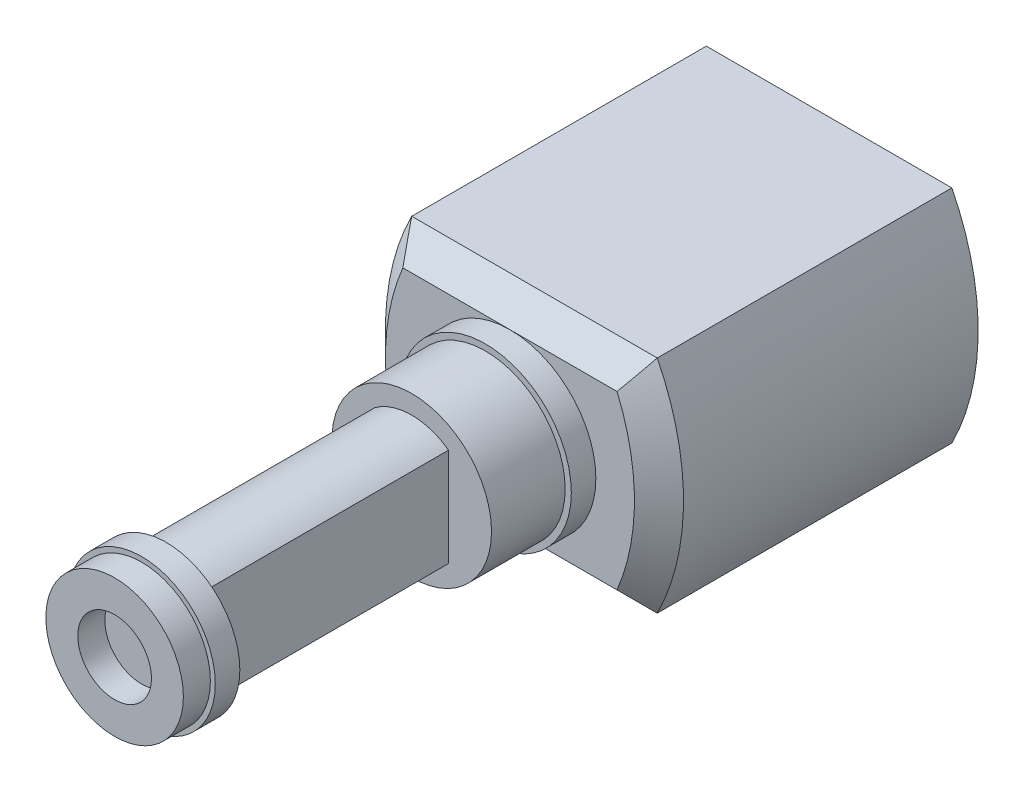
ISO-10303-21;
HEADER;
FILE_DESCRIPTION(('STEP AP214'),'2;1');
FILE_NAME('part.step','',(''),(''),'','','');
FILE_SCHEMA(('AUTOMOTIVE_DESIGN { 1 0 10303 214 1 1 1 1 }'));
ENDSEC;
DATA;
#1=APPLICATION_CONTEXT('core data for automotive mechanical design processes');
#2=APPLICATION_PROTOCOL_DEFINITION('international standard','automotive_design',2000,#1);
#3=PRODUCT_CONTEXT('',#1,'mechanical');
#4=PRODUCT('Part','Part','',(#3));
#5=PRODUCT_RELATED_PRODUCT_CATEGORY('part','',(#4));
#6=PRODUCT_DEFINITION_FORMATION('','',#4);
#7=PRODUCT_DEFINITION_CONTEXT('part definition',#1,'design');
#8=PRODUCT_DEFINITION('design','',#6,#7);
#9=PRODUCT_DEFINITION_SHAPE('','',#8);
#10=(LENGTH_UNIT() NAMED_UNIT(*) SI_UNIT(.MILLI.,.METRE.));
#11=(NAMED_UNIT(*) PLANE_ANGLE_UNIT() SI_UNIT($,.RADIAN.));
#12=(NAMED_UNIT(*) SI_UNIT($,.STERADIAN.) SOLID_ANGLE_UNIT());
#13=UNCERTAINTY_MEASURE_WITH_UNIT(LENGTH_MEASURE(1.E-05),#10,'distance_accuracy_value','');
#14=(GEOMETRIC_REPRESENTATION_CONTEXT(3) GLOBAL_UNCERTAINTY_ASSIGNED_CONTEXT((#13)) GLOBAL_UNIT_ASSIGNED_CONTEXT((#10,
#11,#12)) REPRESENTATION_CONTEXT('',''));
#15=CARTESIAN_POINT('',(0.,0.,0.));
#16=DIRECTION('',(0.,0.,1.));
#17=DIRECTION('',(1.,0.,0.));
#18=AXIS2_PLACEMENT_3D('',#15,#16,#17);
#19=CARTESIAN_POINT('',(-50.,-45.,120.));
#20=DIRECTION('',(0.,1.,0.));
#21=DIRECTION('',(0.,0.,1.));
#22=AXIS2_PLACEMENT_3D('',#19,#20,#21);
#23=PLANE('',#22);
#24=DIRECTION('',(-1.,0.,0.));
#25=VECTOR('',#24,1.);
#26=CARTESIAN_POINT('',(16.,-45.,85.));
#27=LINE('',#26,#25);
#28=CARTESIAN_POINT('',(16.,-45.,85.));
#29=VERTEX_POINT('',#28);
#30=CARTESIAN_POINT('',(-39.,-45.,85.));
#31=VERTEX_POINT('',#30);
#32=EDGE_CURVE('E71',#29,#31,#27,.T.);
#33=ORIENTED_EDGE('',*,*,#32,.F.);
#34=DIRECTION('',(0.,0.,1.));
#35=VECTOR('',#34,1.);
#36=CARTESIAN_POINT('',(16.,-45.,85.));
#37=LINE('',#36,#35);
#38=CARTESIAN_POINT('',(16.,-45.,35.));
#39=VERTEX_POINT('',#38);
#40=EDGE_CURVE('E66',#39,#29,#37,.T.);
#41=ORIENTED_EDGE('',*,*,#40,.F.);
#42=DIRECTION('',(-1.,0.,0.));
#43=VECTOR('',#42,1.);
#44=CARTESIAN_POINT('',(16.,-45.,35.));
#45=LINE('',#44,#43);
#46=CARTESIAN_POINT('',(-39.,-45.,35.));
#47=VERTEX_POINT('',#46);
#48=EDGE_CURVE('E201',#39,#47,#45,.T.);
#49=ORIENTED_EDGE('',*,*,#48,.T.);
#50=DIRECTION('',(0.,0.,1.));
#51=VECTOR('',#50,1.);
#52=CARTESIAN_POINT('',(-39.,-45.,120.));
#53=LINE('',#52,#51);
#54=CARTESIAN_POINT('',(-39.,-45.,20.));
#55=VERTEX_POINT('',#54);
#56=EDGE_CURVE('E358',#55,#47,#53,.T.);
#57=ORIENTED_EDGE('',*,*,#56,.F.);
#58=DIRECTION('',(1.,0.,0.));
#59=VECTOR('',#58,1.);
#60=CARTESIAN_POINT('',(-61.,-45.,20.));
#61=LINE('',#60,#59);
#62=CARTESIAN_POINT('',(-50.,-45.,20.));
#63=VERTEX_POINT('',#62);
#64=EDGE_CURVE('E59',#63,#55,#61,.T.);
#65=ORIENTED_EDGE('',*,*,#64,.F.);
#66=DIRECTION('',(0.,0.,-1.));
#67=VECTOR('',#66,1.);
#68=CARTESIAN_POINT('',(-50.,-45.,120.));
#69=LINE('',#68,#67);
#70=CARTESIAN_POINT('',(-50.,-45.,0.));
#71=VERTEX_POINT('',#70);
#72=EDGE_CURVE('E695',#63,#71,#69,.T.);
#73=ORIENTED_EDGE('',*,*,#72,.T.);
#74=DIRECTION('',(1.,0.,0.));
#75=VECTOR('',#74,1.);
#76=CARTESIAN_POINT('',(-50.,-45.,0.));
#77=LINE('',#76,#75);
#78=CARTESIAN_POINT('',(50.,-45.,0.));
#79=VERTEX_POINT('',#78);
#80=EDGE_CURVE('E680',#71,#79,#77,.T.);
#81=ORIENTED_EDGE('',*,*,#80,.T.);
#82=DIRECTION('',(0.,0.,-1.));
#83=VECTOR('',#82,1.);
#84=CARTESIAN_POINT('',(50.,-45.,120.));
#85=LINE('',#84,#83);
#86=CARTESIAN_POINT('',(50.,-45.,120.));
#87=VERTEX_POINT('',#86);
#88=EDGE_CURVE('E691',#87,#79,#85,.T.);
#89=ORIENTED_EDGE('',*,*,#88,.F.);
#90=DIRECTION('',(1.,0.,0.));
#91=VECTOR('',#90,1.);
#92=CARTESIAN_POINT('',(-50.,-45.,120.));
#93=LINE('',#92,#91);
#94=CARTESIAN_POINT('',(-50.,-45.,120.));
#95=VERTEX_POINT('',#94);
#96=EDGE_CURVE('E654',#95,#87,#93,.T.);
#97=ORIENTED_EDGE('',*,*,#96,.F.);
#98=CARTESIAN_POINT('',(-50.,-45.,100.));
#99=VERTEX_POINT('',#98);
#100=EDGE_CURVE('E696',#95,#99,#69,.T.);
#101=ORIENTED_EDGE('',*,*,#100,.T.);
#102=DIRECTION('',(1.,0.,0.));
#103=VECTOR('',#102,1.);
#104=CARTESIAN_POINT('',(-61.,-45.,100.));
#105=LINE('',#104,#103);
#106=CARTESIAN_POINT('',(-39.,-45.,100.));
#107=VERTEX_POINT('',#106);
#108=EDGE_CURVE('E11',#107,#99,#105,.F.);
#109=ORIENTED_EDGE('',*,*,#108,.F.);
#110=EDGE_CURVE('E350',#31,#107,#53,.T.);
#111=ORIENTED_EDGE('',*,*,#110,.F.);
#112=EDGE_LOOP('',(#33,#41,#49,#57,#65,#73,#81,#89,#97,#101,#109,#111));
#113=FACE_BOUND('',#112,.T.);
#114=ADVANCED_FACE('F49',(#113),#23,.F.);
#115=CARTESIAN_POINT('',(-39.,-45.,60.));
#116=DIRECTION('',(-1.,0.,0.));
#117=DIRECTION('',(0.,0.,1.));
#118=AXIS2_PLACEMENT_3D('',#115,#116,#117);
#119=PLANE('',#118);
#120=DIRECTION('',(0.,-1.,0.));
#121=VECTOR('',#120,1.);
#122=CARTESIAN_POINT('',(-39.,-45.,85.));
#123=LINE('',#122,#121);
#124=CARTESIAN_POINT('',(-39.,-72.,85.));
#125=VERTEX_POINT('',#124);
#126=EDGE_CURVE('E192',#31,#125,#123,.T.);
#127=ORIENTED_EDGE('',*,*,#126,.F.);
#128=ORIENTED_EDGE('',*,*,#110,.T.);
#129=CARTESIAN_POINT('',(-39.,-45.,60.));
#130=DIRECTION('',(-1.,0.,0.));
#131=DIRECTION('',(0.,0.,1.));
#132=AXIS2_PLACEMENT_3D('',#129,#130,#131);
#133=CIRCLE('',#132,40.);
#134=EDGE_CURVE('E194',#55,#107,#133,.T.);
#135=ORIENTED_EDGE('',*,*,#134,.F.);
#136=ORIENTED_EDGE('',*,*,#56,.T.);
#137=DIRECTION('',(0.,1.,0.));
#138=VECTOR('',#137,1.);
#139=CARTESIAN_POINT('',(-39.,-45.,35.));
#140=LINE('',#139,#138);
#141=CARTESIAN_POINT('',(-39.,-72.,35.));
#142=VERTEX_POINT('',#141);
#143=EDGE_CURVE('E189',#142,#47,#140,.T.);
#144=ORIENTED_EDGE('',*,*,#143,.F.);
#145=CARTESIAN_POINT('',(-39.,-9.38517357398977,60.));
#146=DIRECTION('',(1.,0.,0.));
#147=DIRECTION('',(0.,0.,-1.));
#148=AXIS2_PLACEMENT_3D('',#145,#146,#147);
#149=CIRCLE('',#148,67.4211872363531);
#150=EDGE_CURVE('E352',#125,#142,#149,.T.);
#151=ORIENTED_EDGE('',*,*,#150,.F.);
#152=EDGE_LOOP('',(#127,#128,#135,#136,#144,#151));
#153=FACE_BOUND('',#152,.T.);
#154=ADVANCED_FACE('F227',(#153),#119,.F.);
#155=CARTESIAN_POINT('',(39.3028554974588,0.,120.));
#156=DIRECTION('',(0.,0.,-1.));
#157=DIRECTION('',(-1.,0.,0.));
#158=AXIS2_PLACEMENT_3D('',#155,#156,#157);
#159=CYLINDRICAL_SURFACE('',#158,100.);
#160=CARTESIAN_POINT('',(-50.,-45.,100.));
#161=CARTESIAN_POINT('',(-50.2575145026989,-44.4889804950428,100.000004959184));
#162=CARTESIAN_POINT('',(-50.5106326873442,-43.9757305050414,99.9902069155624));
#163=CARTESIAN_POINT('',(-51.0077513577765,-42.9455579457033,99.9505307291951));
#164=CARTESIAN_POINT('',(-51.2517511360193,-42.428635095059,99.9206510316117));
#165=CARTESIAN_POINT('',(-51.7303912522015,-41.391717468259,99.840316600475));
#166=CARTESIAN_POINT('',(-51.9650267016564,-40.8717212461962,99.789851270884));
#167=CARTESIAN_POINT('',(-52.4244740255998,-39.8299050493603,99.6679378151953));
#168=CARTESIAN_POINT('',(-52.6492861218073,-39.308085116037,99.5964901629626));
#169=CARTESIAN_POINT('',(-53.3092096445117,-37.7397882514892,99.3498377402756));
#170=CARTESIAN_POINT('',(-53.7292147486106,-36.6917616100942,99.1424207839221));
#171=CARTESIAN_POINT('',(-54.5268864944688,-34.6010369531128,98.6395862258692));
#172=CARTESIAN_POINT('',(-54.9045611222125,-33.5583379679674,98.3441852616505));
#173=CARTESIAN_POINT('',(-55.6181238744516,-31.4835703939032,97.6630096287439));
#174=CARTESIAN_POINT('',(-55.9538571281414,-30.4515534023426,97.276914345942));
#175=CARTESIAN_POINT('',(-56.5819842178003,-28.4119069849537,96.4151198297498));
#176=CARTESIAN_POINT('',(-56.8743750524622,-27.4042792520327,95.9394143963525));
#177=CARTESIAN_POINT('',(-57.4164433001584,-25.4249642338286,94.900792144347));
#178=CARTESIAN_POINT('',(-57.666180673093,-24.4532280267028,94.3379999060999));
#179=CARTESIAN_POINT('',(-58.125424075549,-22.5540440887892,93.1277347231729));
#180=CARTESIAN_POINT('',(-58.3349324993936,-21.6265937246924,92.480266822028));
#181=CARTESIAN_POINT('',(-58.7059783214294,-19.8752367925533,91.1430896171818));
#182=CARTESIAN_POINT('',(-58.8695324360717,-19.0484403311266,90.4577175180242));
#183=CARTESIAN_POINT('',(-59.1662561613783,-17.4497875447128,89.0196763352655));
#184=CARTESIAN_POINT('',(-59.2994267893559,-16.6779293808529,88.2670095060311));
#185=CARTESIAN_POINT('',(-59.5387828447042,-15.1952287244079,86.6990732348288));
#186=CARTESIAN_POINT('',(-59.6449536310704,-14.4844194741274,85.8837701382276));
#187=CARTESIAN_POINT('',(-59.8337695315128,-13.1300141528581,84.1965763893211));
#188=CARTESIAN_POINT('',(-59.9164142924848,-12.4864190907849,83.3246848879165));
#189=CARTESIAN_POINT('',(-60.0618863771138,-11.270481226524,81.528985502298));
#190=CARTESIAN_POINT('',(-60.1246821155331,-10.698252855488,80.6050976018441));
#191=CARTESIAN_POINT('',(-60.2337769808131,-9.63052034694264,78.7130935635876));
#192=CARTESIAN_POINT('',(-60.2800761712338,-9.13501591382643,77.7449775962082));
#193=CARTESIAN_POINT('',(-60.3594193075909,-8.22435323407913,75.7712684558029));
#194=CARTESIAN_POINT('',(-60.3924645525275,-7.80918711566974,74.7656789660663));
#195=CARTESIAN_POINT('',(-60.4481735082475,-7.06205521218068,72.7237693849129));
#196=CARTESIAN_POINT('',(-60.4708370477071,-6.73009080017593,71.6874487866573));
#197=CARTESIAN_POINT('',(-60.5086067050459,-6.14492596714399,69.5666707930246));
#198=CARTESIAN_POINT('',(-60.5235247445409,-5.89373753930624,68.4816544140698));
#199=CARTESIAN_POINT('',(-60.5469452598326,-5.48267409038658,66.29438537262));
#200=CARTESIAN_POINT('',(-60.5554476413231,-5.32280041158509,65.1921324570013));
#201=CARTESIAN_POINT('',(-60.5673052838955,-5.09548640111748,62.9779915436194));
#202=CARTESIAN_POINT('',(-60.5706600086419,-5.02805570118581,61.8661025540068));
#203=CARTESIAN_POINT('',(-60.572761699177,-4.98613345843167,59.6405706708872));
#204=CARTESIAN_POINT('',(-60.5715086561313,-5.01164209380126,58.5269277740215));
#205=CARTESIAN_POINT('',(-60.5641588243351,-5.15603833517959,56.2961191903085));
#206=CARTESIAN_POINT('',(-60.5580205548909,-5.2757255170237,55.1790053042739));
#207=CARTESIAN_POINT('',(-60.5398772185023,-5.60860473061139,52.958836391483));
#208=CARTESIAN_POINT('',(-60.5278721042186,-5.82179751684534,51.8557814782415));
#209=CARTESIAN_POINT('',(-60.4962917242754,-6.3401545462993,49.67158218095));
#210=CARTESIAN_POINT('',(-60.4767163217885,-6.64532045184538,48.5904381932959));
#211=CARTESIAN_POINT('',(-60.4276222636608,-7.34539491460195,46.457835423632));
#212=CARTESIAN_POINT('',(-60.3981036394846,-7.74030318782793,45.4063765476972));
#213=CARTESIAN_POINT('',(-60.3262048869344,-8.61644826687708,43.3418723773045));
#214=CARTESIAN_POINT('',(-60.2838389092234,-9.09758985411858,42.3287861915279));
#215=CARTESIAN_POINT('',(-60.1828136852166,-10.1428377651297,40.3471878132357));
#216=CARTESIAN_POINT('',(-60.1241544152144,-10.7069442096111,39.3786756855769));
#217=CARTESIAN_POINT('',(-59.9867858690692,-11.9136770106138,37.4933830784486));
#218=CARTESIAN_POINT('',(-59.9080770643757,-12.556301520658,36.5766013831968));
#219=CARTESIAN_POINT('',(-59.7266701552798,-13.914828544418,34.8015652001785));
#220=CARTESIAN_POINT('',(-59.62397244248,-14.6307298618335,33.9433097573067));
#221=CARTESIAN_POINT('',(-59.3922998183614,-16.1190970482872,32.3033904581545));
#222=CARTESIAN_POINT('',(-59.2637173208638,-16.8906191128443,31.5208146208771));
#223=CARTESIAN_POINT('',(-58.9758151717442,-18.4922880086693,30.0243039276647));
#224=CARTESIAN_POINT('',(-58.816495782265,-19.3224343399157,29.3103684864005));
#225=CARTESIAN_POINT('',(-58.4639736496879,-21.0335357027999,27.956304726088));
#226=CARTESIAN_POINT('',(-58.2707857482991,-21.914468366053,27.3161442805068));
#227=CARTESIAN_POINT('',(-57.8478086523549,-23.719344626821,26.1132807598742));
#228=CARTESIAN_POINT('',(-57.6180205780592,-24.6432869072829,25.5505753150589));
#229=CARTESIAN_POINT('',(-57.1256063416069,-26.5038931893504,24.5176079311349));
#230=CARTESIAN_POINT('',(-56.8638578746364,-27.439774729962,24.045516142323));
#231=CARTESIAN_POINT('',(-56.3024205760292,-29.336136218961,23.1797636127467));
#232=CARTESIAN_POINT('',(-56.0027304959743,-30.2966169759228,22.7861054538337));
#233=CARTESIAN_POINT('',(-55.3649558849523,-32.2342417241874,22.0777096776537));
#234=CARTESIAN_POINT('',(-55.0268548837521,-33.2113927097455,21.7630061023256));
#235=CARTESIAN_POINT('',(-54.3128041965,-35.1738240224274,21.2123150966895));
#236=CARTESIAN_POINT('',(-53.936861542153,-36.1591028081267,20.9763130771459));
#237=CARTESIAN_POINT('',(-53.2784234181899,-37.8049383771586,20.6466646295495));
#238=CARTESIAN_POINT('',(-53.0060183937048,-38.4653821105773,20.5317404253973));
#239=CARTESIAN_POINT('',(-52.4452360501806,-39.7844324164767,20.3358822477574));
#240=CARTESIAN_POINT('',(-52.1568612609275,-40.443039262677,20.2549429080289));
#241=CARTESIAN_POINT('',(-51.5655357162397,-41.7546556494803,20.1264409342995));
#242=CARTESIAN_POINT('',(-51.2626286723406,-42.4076757732124,20.0787841838325));
#243=CARTESIAN_POINT('',(-50.6421453911592,-43.7083203255714,20.0155557304445));
#244=CARTESIAN_POINT('',(-50.3245685145279,-44.3559445175751,19.9999854272849));
#245=CARTESIAN_POINT('',(-50.,-45.,20.));
#246=B_SPLINE_CURVE_WITH_KNOTS('',3,(#160,#161,#162,#163,#164,#165,#166,#167,#168,#169,#170,
#171,#172,#173,#174,#175,#176,#177,#178,#179,#180,#181,#182,#183,#184,#185,#186,#187,#188,#189,
#190,#191,#192,#193,#194,#195,#196,#197,#198,#199,#200,#201,#202,#203,#204,#205,#206,#207,#208,
#209,#210,#211,#212,#213,#214,#215,#216,#217,#218,#219,#220,#221,#222,#223,#224,#225,#226,#227,
#228,#229,#230,#231,#232,#233,#234,#235,#236,#237,#238,#239,#240,#241,#242,#243,#244,#245),
.UNSPECIFIED.,.F.,.F.,(4,2,2,2,2,2,2,2,2,2,2,2,2,2,2,2,2,2,2,2,2,2,2,2,2,2,2,2,2,2,2,2,2,2,2,2,
2,2,2,2,2,2,4),(0.,1.71662188098538,3.43337668809481,5.1510162773036,6.868617078296,
10.3080686730842,13.7468702915872,17.1980164158165,20.6494014080071,24.0958939690318,
27.5421813400996,30.7972467681108,34.0522031925905,37.3089209125645,40.5656875103304,
43.8276107270397,47.0895213756898,50.3511122509723,53.6127569486334,56.9502793027659,
60.2878507155184,63.6257698470419,66.9636953783418,70.3302697246236,73.6968712360653,
77.0635335992552,80.4301853089859,83.7931422208729,87.1561040258278,90.5189867606124,
93.8818146024949,97.1970550807682,100.512267285915,103.826030328377,107.139691962509,
110.377073638897,113.61456186471,116.853443571425,120.091724538949,122.261626977542,
124.431186657615,126.594586142898,128.75808000382),.UNSPECIFIED.);
#247=EDGE_CURVE('E207',#99,#63,#246,.T.);
#248=ORIENTED_EDGE('',*,*,#247,.F.);
#249=ORIENTED_EDGE('',*,*,#100,.F.);
#250=CARTESIAN_POINT('',(39.3028554974588,0.,120.));
#251=DIRECTION('',(0.,0.,1.));
#252=DIRECTION('',(1.,0.,0.));
#253=AXIS2_PLACEMENT_3D('',#250,#251,#252);
#254=CIRCLE('',#253,100.);
#255=CARTESIAN_POINT('',(-50.,45.,120.));
#256=VERTEX_POINT('',#255);
#257=EDGE_CURVE('E645',#256,#95,#254,.T.);
#258=ORIENTED_EDGE('',*,*,#257,.F.);
#259=DIRECTION('',(0.,0.,-1.));
#260=VECTOR('',#259,1.);
#261=CARTESIAN_POINT('',(-50.,45.,120.));
#262=LINE('',#261,#260);
#263=CARTESIAN_POINT('',(-50.,45.,0.));
#264=VERTEX_POINT('',#263);
#265=EDGE_CURVE('E675',#256,#264,#262,.T.);
#266=ORIENTED_EDGE('',*,*,#265,.T.);
#267=CARTESIAN_POINT('',(39.3028554974588,0.,0.));
#268=DIRECTION('',(0.,0.,1.));
#269=DIRECTION('',(1.,0.,0.));
#270=AXIS2_PLACEMENT_3D('',#267,#268,#269);
#271=CIRCLE('',#270,100.);
#272=EDGE_CURVE('E676',#264,#71,#271,.T.);
#273=ORIENTED_EDGE('',*,*,#272,.T.);
#274=ORIENTED_EDGE('',*,*,#72,.F.);
#275=EDGE_LOOP('',(#248,#249,#258,#266,#273,#274));
#276=FACE_BOUND('',#275,.T.);
#277=ADVANCED_FACE('F51',(#276),#159,.T.);
#278=CARTESIAN_POINT('',(39.3028554974588,0.,130.));
#279=DIRECTION('',(0.,0.,1.));
#280=DIRECTION('',(1.,0.,0.));
#281=AXIS2_PLACEMENT_3D('',#278,#279,#280);
#282=PLANE('',#281);
#283=CARTESIAN_POINT('',(0.,0.,130.));
#284=DIRECTION('',(0.,0.,1.));
#285=DIRECTION('',(1.,0.,0.));
#286=AXIS2_PLACEMENT_3D('',#283,#284,#285);
#287=CIRCLE('',#286,35.);
#288=CARTESIAN_POINT('',(0.,35.,130.));
#289=VERTEX_POINT('',#288);
#290=CARTESIAN_POINT('',(0.,-34.9999999999999,130.));
#291=VERTEX_POINT('',#290);
#292=EDGE_CURVE('E708',#289,#291,#287,.T.);
#293=ORIENTED_EDGE('',*,*,#292,.F.);
#294=DIRECTION('',(1.,0.,0.));
#295=VECTOR('',#294,1.);
#296=CARTESIAN_POINT('',(50.,35.,130.));
#297=LINE('',#296,#295);
#298=CARTESIAN_POINT('',(-43.6127642614262,35.,130.));
#299=VERTEX_POINT('',#298);
#300=EDGE_CURVE('E724',#289,#299,#297,.F.);
#301=ORIENTED_EDGE('',*,*,#300,.T.);
#302=CARTESIAN_POINT('',(39.3028554974588,0.,130.));
#303=DIRECTION('',(0.,0.,1.));
#304=DIRECTION('',(1.,0.,0.));
#305=AXIS2_PLACEMENT_3D('',#302,#303,#304);
#306=CIRCLE('',#305,90.);
#307=CARTESIAN_POINT('',(-43.6127642614262,-34.9999999999999,130.));
#308=VERTEX_POINT('',#307);
#309=EDGE_CURVE('E320',#299,#308,#306,.T.);
#310=ORIENTED_EDGE('',*,*,#309,.T.);
#311=DIRECTION('',(-1.,0.,0.));
#312=VECTOR('',#311,1.);
#313=CARTESIAN_POINT('',(-50.,-34.9999999999999,130.));
#314=LINE('',#313,#312);
#315=EDGE_CURVE('E734',#308,#291,#314,.F.);
#316=ORIENTED_EDGE('',*,*,#315,.T.);
#317=EDGE_LOOP('',(#293,#301,#310,#316));
#318=FACE_BOUND('',#317,.T.);
#319=ADVANCED_FACE('F285',(#318),#282,.T.);
#320=CARTESIAN_POINT('',(-39.3028554974588,0.,120.));
#321=DIRECTION('',(0.,0.,-1.));
#322=DIRECTION('',(-1.,0.,0.));
#323=AXIS2_PLACEMENT_3D('',#320,#321,#322);
#324=CYLINDRICAL_SURFACE('',#323,100.);
#325=CARTESIAN_POINT('',(-39.3028554974588,0.,0.));
#326=DIRECTION('',(0.,0.,1.));
#327=DIRECTION('',(-1.,0.,0.));
#328=AXIS2_PLACEMENT_3D('',#325,#326,#327);
#329=CIRCLE('',#328,100.);
#330=CARTESIAN_POINT('',(50.,45.,0.));
#331=VERTEX_POINT('',#330);
#332=EDGE_CURVE('E662',#79,#331,#329,.T.);
#333=ORIENTED_EDGE('',*,*,#332,.T.);
#334=DIRECTION('',(0.,0.,-1.));
#335=VECTOR('',#334,1.);
#336=CARTESIAN_POINT('',(50.,45.,120.));
#337=LINE('',#336,#335);
#338=CARTESIAN_POINT('',(50.,45.,120.));
#339=VERTEX_POINT('',#338);
#340=EDGE_CURVE('E687',#339,#331,#337,.T.);
#341=ORIENTED_EDGE('',*,*,#340,.F.);
#342=CARTESIAN_POINT('',(-39.3028554974588,0.,120.));
#343=DIRECTION('',(0.,0.,1.));
#344=DIRECTION('',(-1.,0.,0.));
#345=AXIS2_PLACEMENT_3D('',#342,#343,#344);
#346=CIRCLE('',#345,100.);
#347=EDGE_CURVE('E660',#87,#339,#346,.T.);
#348=ORIENTED_EDGE('',*,*,#347,.F.);
#349=ORIENTED_EDGE('',*,*,#88,.T.);
#350=EDGE_LOOP('',(#333,#341,#348,#349));
#351=FACE_BOUND('',#350,.T.);
#352=ADVANCED_FACE('F335',(#351),#324,.T.);
#353=CARTESIAN_POINT('',(-50.,45.,120.));
#354=DIRECTION('',(0.,-1.,0.));
#355=DIRECTION('',(0.,0.,-1.));
#356=AXIS2_PLACEMENT_3D('',#353,#354,#355);
#357=PLANE('',#356);
#358=DIRECTION('',(-1.,0.,0.));
#359=VECTOR('',#358,1.);
#360=CARTESIAN_POINT('',(-50.,45.,0.));
#361=LINE('',#360,#359);
#362=EDGE_CURVE('E655',#331,#264,#361,.T.);
#363=ORIENTED_EDGE('',*,*,#362,.T.);
#364=ORIENTED_EDGE('',*,*,#265,.F.);
#365=DIRECTION('',(-1.,0.,0.));
#366=VECTOR('',#365,1.);
#367=CARTESIAN_POINT('',(-50.,45.,120.));
#368=LINE('',#367,#366);
#369=EDGE_CURVE('E671',#339,#256,#368,.T.);
#370=ORIENTED_EDGE('',*,*,#369,.F.);
#371=ORIENTED_EDGE('',*,*,#340,.T.);
#372=EDGE_LOOP('',(#363,#364,#370,#371));
#373=FACE_BOUND('',#372,.T.);
#374=ADVANCED_FACE('F331',(#373),#357,.F.);
#375=CARTESIAN_POINT('',(39.3028554974588,0.,0.));
#376=DIRECTION('',(0.,0.,1.));
#377=DIRECTION('',(1.,0.,0.));
#378=AXIS2_PLACEMENT_3D('',#375,#376,#377);
#379=PLANE('',#378);
#380=ORIENTED_EDGE('',*,*,#272,.F.);
#381=ORIENTED_EDGE('',*,*,#362,.F.);
#382=ORIENTED_EDGE('',*,*,#332,.F.);
#383=ORIENTED_EDGE('',*,*,#80,.F.);
#384=EDGE_LOOP('',(#380,#381,#382,#383));
#385=FACE_BOUND('',#384,.T.);
#386=ADVANCED_FACE('F327',(#385),#379,.F.);
#387=CARTESIAN_POINT('',(39.3028554974588,0.,120.));
#388=DIRECTION('',(0.,0.,-1.));
#389=DIRECTION('',(1.,0.,0.));
#390=AXIS2_PLACEMENT_3D('',#387,#388,#389);
#391=CONICAL_SURFACE('',#390,100.,0.78539816339745);
#392=ORIENTED_EDGE('',*,*,#257,.T.);
#393=CARTESIAN_POINT('',(-43.6127642614262,-34.9999999999999,130.));
#394=CARTESIAN_POINT('',(-44.1619231895788,-35.827897686687,129.172102313313));
#395=CARTESIAN_POINT('',(-44.7066190332412,-36.657272926264,128.342727073736));
#396=CARTESIAN_POINT('',(-45.7874293356179,-38.3187662385271,126.681233761473));
#397=CARTESIAN_POINT('',(-46.3235442082515,-39.1508841765649,125.849115823435));
#398=CARTESIAN_POINT('',(-47.3875871165562,-40.8177255827111,124.182274417289));
#399=CARTESIAN_POINT('',(-47.9155152030539,-41.652449034605,123.347550965395));
#400=CARTESIAN_POINT('',(-48.9635481765775,-43.3243965865883,121.675603413412));
#401=CARTESIAN_POINT('',(-49.4836526838744,-44.1616208057075,120.838379194292));
#402=CARTESIAN_POINT('',(-50.,-45.,120.));
#403=B_SPLINE_CURVE_WITH_KNOTS('',3,(#393,#394,#395,#396,#397,#398,#399,#400,#401,#402),
.UNSPECIFIED.,.F.,.F.,(4,2,2,2,4),(0.,3.87963028203751,7.75907285537981,11.6384913341418,
15.5180975026528),.UNSPECIFIED.);
#404=EDGE_CURVE('E297',#308,#95,#403,.T.);
#405=ORIENTED_EDGE('',*,*,#404,.F.);
#406=ORIENTED_EDGE('',*,*,#309,.F.);
#407=CARTESIAN_POINT('',(-43.6127642614262,35.,130.));
#408=CARTESIAN_POINT('',(-44.1619231895788,35.8278976866871,129.172102313313));
#409=CARTESIAN_POINT('',(-44.7066190332412,36.6572729262641,128.342727073736));
#410=CARTESIAN_POINT('',(-45.7874293356179,38.3187662385272,126.681233761473));
#411=CARTESIAN_POINT('',(-46.3235442082514,39.1508841765649,125.849115823435));
#412=CARTESIAN_POINT('',(-47.3875871165562,40.8177255827111,124.182274417289));
#413=CARTESIAN_POINT('',(-47.9155152030539,41.652449034605,123.347550965395));
#414=CARTESIAN_POINT('',(-48.9635481765775,43.3243965865883,121.675603413412));
#415=CARTESIAN_POINT('',(-49.4836526838743,44.1616208057076,120.838379194292));
#416=CARTESIAN_POINT('',(-50.,45.,120.));
#417=B_SPLINE_CURVE_WITH_KNOTS('',3,(#407,#408,#409,#410,#411,#412,#413,#414,#415,#416),
.UNSPECIFIED.,.F.,.F.,(4,2,2,2,4),(0.,3.8796302820375,7.75907285537979,11.6384913341418,
15.5180975026528),.UNSPECIFIED.);
#418=EDGE_CURVE('E649',#299,#256,#417,.T.);
#419=ORIENTED_EDGE('',*,*,#418,.T.);
#420=EDGE_LOOP('',(#392,#405,#406,#419));
#421=FACE_BOUND('',#420,.T.);
#422=ADVANCED_FACE('F291',(#421),#391,.T.);
#423=CARTESIAN_POINT('',(-50.,-45.,120.));
#424=DIRECTION('',(0.,-0.707106781186546,0.707106781186549));
#425=DIRECTION('',(0.,-0.707106781186549,-0.707106781186546));
#426=AXIS2_PLACEMENT_3D('',#423,#424,#425);
#427=PLANE('',#426);
#428=ORIENTED_EDGE('',*,*,#96,.T.);
#429=CARTESIAN_POINT('',(43.6127642614262,-34.9999999999999,130.));
#430=CARTESIAN_POINT('',(44.1619231895788,-35.827897686687,129.172102313313));
#431=CARTESIAN_POINT('',(44.7066190332412,-36.657272926264,128.342727073736));
#432=CARTESIAN_POINT('',(45.7874293356179,-38.3187662385271,126.681233761473));
#433=CARTESIAN_POINT('',(46.3235442082515,-39.1508841765649,125.849115823435));
#434=CARTESIAN_POINT('',(47.3875871165562,-40.8177255827111,124.182274417289));
#435=CARTESIAN_POINT('',(47.9155152030539,-41.652449034605,123.347550965395));
#436=CARTESIAN_POINT('',(48.9635481765775,-43.3243965865883,121.675603413412));
#437=CARTESIAN_POINT('',(49.4836526838744,-44.1616208057075,120.838379194292));
#438=CARTESIAN_POINT('',(50.,-45.,120.));
#439=B_SPLINE_CURVE_WITH_KNOTS('',3,(#429,#430,#431,#432,#433,#434,#435,#436,#437,#438),
.UNSPECIFIED.,.F.,.F.,(4,2,2,2,4),(0.,3.87963028203751,7.75907285537981,11.6384913341418,
15.5180975026528),.UNSPECIFIED.);
#440=CARTESIAN_POINT('',(43.6127642614262,-34.9999999999999,130.));
#441=VERTEX_POINT('',#440);
#442=EDGE_CURVE('E305',#441,#87,#439,.T.);
#443=ORIENTED_EDGE('',*,*,#442,.F.);
#444=EDGE_CURVE('E737',#291,#441,#314,.F.);
#445=ORIENTED_EDGE('',*,*,#444,.F.);
#446=ORIENTED_EDGE('',*,*,#315,.F.);
#447=ORIENTED_EDGE('',*,*,#404,.T.);
#448=EDGE_LOOP('',(#428,#443,#445,#446,#447));
#449=FACE_BOUND('',#448,.T.);
#450=ADVANCED_FACE('F286',(#449),#427,.T.);
#451=CARTESIAN_POINT('',(-39.3028554974588,0.,120.));
#452=DIRECTION('',(0.,0.,-1.));
#453=DIRECTION('',(1.,0.,0.));
#454=AXIS2_PLACEMENT_3D('',#451,#452,#453);
#455=CONICAL_SURFACE('',#454,100.,0.78539816339745);
#456=ORIENTED_EDGE('',*,*,#347,.T.);
#457=CARTESIAN_POINT('',(43.6127642614262,35.,130.));
#458=CARTESIAN_POINT('',(44.1619231895787,35.8278976866871,129.172102313313));
#459=CARTESIAN_POINT('',(44.7066190332412,36.6572729262641,128.342727073736));
#460=CARTESIAN_POINT('',(45.7874293356179,38.3187662385272,126.681233761473));
#461=CARTESIAN_POINT('',(46.3235442082514,39.1508841765649,125.849115823435));
#462=CARTESIAN_POINT('',(47.3875871165562,40.8177255827111,124.182274417289));
#463=CARTESIAN_POINT('',(47.9155152030539,41.652449034605,123.347550965395));
#464=CARTESIAN_POINT('',(48.9635481765775,43.3243965865884,121.675603413412));
#465=CARTESIAN_POINT('',(49.4836526838743,44.1616208057076,120.838379194292));
#466=CARTESIAN_POINT('',(50.,45.,120.));
#467=B_SPLINE_CURVE_WITH_KNOTS('',3,(#457,#458,#459,#460,#461,#462,#463,#464,#465,#466),
.UNSPECIFIED.,.F.,.F.,(4,2,2,2,4),(0.,3.87963028203751,7.75907285537981,11.6384913341418,
15.5180975026528),.UNSPECIFIED.);
#468=CARTESIAN_POINT('',(43.6127642614262,35.,130.));
#469=VERTEX_POINT('',#468);
#470=EDGE_CURVE('E315',#469,#339,#467,.T.);
#471=ORIENTED_EDGE('',*,*,#470,.F.);
#472=CARTESIAN_POINT('',(-39.3028554974588,0.,130.));
#473=DIRECTION('',(0.,0.,1.));
#474=DIRECTION('',(1.,0.,0.));
#475=AXIS2_PLACEMENT_3D('',#472,#473,#474);
#476=CIRCLE('',#475,90.);
#477=EDGE_CURVE('E730',#441,#469,#476,.T.);
#478=ORIENTED_EDGE('',*,*,#477,.F.);
#479=ORIENTED_EDGE('',*,*,#442,.T.);
#480=EDGE_LOOP('',(#456,#471,#478,#479));
#481=FACE_BOUND('',#480,.T.);
#482=ADVANCED_FACE('F290',(#481),#455,.T.);
#483=CARTESIAN_POINT('',(50.,45.,120.));
#484=DIRECTION('',(0.,0.707106781186546,0.707106781186549));
#485=DIRECTION('',(0.,-0.707106781186549,0.707106781186546));
#486=AXIS2_PLACEMENT_3D('',#483,#484,#485);
#487=PLANE('',#486);
#488=ORIENTED_EDGE('',*,*,#369,.T.);
#489=ORIENTED_EDGE('',*,*,#418,.F.);
#490=ORIENTED_EDGE('',*,*,#300,.F.);
#491=EDGE_CURVE('E665',#469,#289,#297,.F.);
#492=ORIENTED_EDGE('',*,*,#491,.F.);
#493=ORIENTED_EDGE('',*,*,#470,.T.);
#494=EDGE_LOOP('',(#488,#489,#490,#492,#493));
#495=FACE_BOUND('',#494,.T.);
#496=ADVANCED_FACE('F283',(#495),#487,.T.);
#497=EDGE_CURVE('E698',#291,#289,#287,.T.);
#498=ORIENTED_EDGE('',*,*,#497,.F.);
#499=ORIENTED_EDGE('',*,*,#444,.T.);
#500=ORIENTED_EDGE('',*,*,#477,.T.);
#501=ORIENTED_EDGE('',*,*,#491,.T.);
#502=EDGE_LOOP('',(#498,#499,#500,#501));
#503=FACE_BOUND('',#502,.T.);
#504=ADVANCED_FACE('F279',(#503),#282,.T.);
#505=CARTESIAN_POINT('',(0.,0.,140.));
#506=DIRECTION('',(0.,0.,-1.));
#507=DIRECTION('',(-1.,0.,0.));
#508=AXIS2_PLACEMENT_3D('',#505,#506,#507);
#509=CYLINDRICAL_SURFACE('',#508,35.);
#510=CARTESIAN_POINT('',(0.,0.,140.));
#511=DIRECTION('',(0.,0.,1.));
#512=DIRECTION('',(1.,0.,0.));
#513=AXIS2_PLACEMENT_3D('',#510,#511,#512);
#514=CIRCLE('',#513,35.);
#515=CARTESIAN_POINT('',(35.,0.,140.));
#516=VERTEX_POINT('',#515);
#517=EDGE_CURVE('E743',#516,#516,#514,.T.);
#518=ORIENTED_EDGE('',*,*,#517,.F.);
#519=EDGE_LOOP('',(#518));
#520=FACE_BOUND('',#519,.T.);
#521=ORIENTED_EDGE('',*,*,#292,.T.);
#522=ORIENTED_EDGE('',*,*,#497,.T.);
#523=EDGE_LOOP('',(#521,#522));
#524=FACE_BOUND('',#523,.T.);
#525=ADVANCED_FACE('F275',(#520,#524),#509,.T.);
#526=CARTESIAN_POINT('',(0.,0.,140.));
#527=DIRECTION('',(0.,0.,1.));
#528=DIRECTION('',(1.,0.,0.));
#529=AXIS2_PLACEMENT_3D('',#526,#527,#528);
#530=PLANE('',#529);
#531=CARTESIAN_POINT('',(0.,0.,140.));
#532=DIRECTION('',(0.,0.,1.));
#533=DIRECTION('',(1.,0.,0.));
#534=AXIS2_PLACEMENT_3D('',#531,#532,#533);
#535=CIRCLE('',#534,32.5);
#536=CARTESIAN_POINT('',(32.5,0.,140.));
#537=VERTEX_POINT('',#536);
#538=EDGE_CURVE('E703',#537,#537,#535,.T.);
#539=ORIENTED_EDGE('',*,*,#538,.F.);
#540=EDGE_LOOP('',(#539));
#541=FACE_BOUND('',#540,.T.);
#542=ORIENTED_EDGE('',*,*,#517,.T.);
#543=EDGE_LOOP('',(#542));
#544=FACE_BOUND('',#543,.T.);
#545=ADVANCED_FACE('F271',(#541,#544),#530,.T.);
#546=CARTESIAN_POINT('',(0.,0.,170.));
#547=DIRECTION('',(0.,0.,-1.));
#548=DIRECTION('',(-1.,0.,0.));
#549=AXIS2_PLACEMENT_3D('',#546,#547,#548);
#550=CYLINDRICAL_SURFACE('',#549,32.5);
#551=CARTESIAN_POINT('',(0.,0.,170.));
#552=DIRECTION('',(0.,0.,1.));
#553=DIRECTION('',(1.,0.,0.));
#554=AXIS2_PLACEMENT_3D('',#551,#552,#553);
#555=CIRCLE('',#554,32.5);
#556=CARTESIAN_POINT('',(32.5,0.,170.));
#557=VERTEX_POINT('',#556);
#558=EDGE_CURVE('E750',#557,#557,#555,.T.);
#559=ORIENTED_EDGE('',*,*,#558,.F.);
#560=EDGE_LOOP('',(#559));
#561=FACE_BOUND('',#560,.T.);
#562=ORIENTED_EDGE('',*,*,#538,.T.);
#563=EDGE_LOOP('',(#562));
#564=FACE_BOUND('',#563,.T.);
#565=ADVANCED_FACE('F267',(#561,#564),#550,.T.);
#566=CARTESIAN_POINT('',(0.,0.,170.));
#567=DIRECTION('',(0.,0.,1.));
#568=DIRECTION('',(1.,0.,0.));
#569=AXIS2_PLACEMENT_3D('',#566,#567,#568);
#570=PLANE('',#569);
#571=CARTESIAN_POINT('',(0.,-0.676277990128409,170.));
#572=DIRECTION('',(0.,0.,1.));
#573=DIRECTION('',(-1.,0.,0.));
#574=AXIS2_PLACEMENT_3D('',#571,#572,#573);
#575=CIRCLE('',#574,25.5442453700451);
#576=CARTESIAN_POINT('',(15.,20.,170.));
#577=VERTEX_POINT('',#576);
#578=CARTESIAN_POINT('',(-15.,20.,170.));
#579=VERTEX_POINT('',#578);
#580=EDGE_CURVE('E785',#577,#579,#575,.T.);
#581=ORIENTED_EDGE('',*,*,#580,.F.);
#582=DIRECTION('',(0.,1.,0.));
#583=VECTOR('',#582,1.);
#584=CARTESIAN_POINT('',(15.,20.,170.));
#585=LINE('',#584,#583);
#586=CARTESIAN_POINT('',(15.,-20.,170.));
#587=VERTEX_POINT('',#586);
#588=EDGE_CURVE('E772',#587,#577,#585,.T.);
#589=ORIENTED_EDGE('',*,*,#588,.F.);
#590=CARTESIAN_POINT('',(0.,0.676277990128409,170.));
#591=DIRECTION('',(0.,0.,1.));
#592=DIRECTION('',(1.,0.,0.));
#593=AXIS2_PLACEMENT_3D('',#590,#591,#592);
#594=CIRCLE('',#593,25.5442453700451);
#595=CARTESIAN_POINT('',(-15.,-20.,170.));
#596=VERTEX_POINT('',#595);
#597=EDGE_CURVE('E777',#596,#587,#594,.T.);
#598=ORIENTED_EDGE('',*,*,#597,.F.);
#599=DIRECTION('',(0.,-1.,0.));
#600=VECTOR('',#599,1.);
#601=CARTESIAN_POINT('',(-15.,20.,170.));
#602=LINE('',#601,#600);
#603=EDGE_CURVE('E781',#579,#596,#602,.T.);
#604=ORIENTED_EDGE('',*,*,#603,.F.);
#605=EDGE_LOOP('',(#581,#589,#598,#604));
#606=FACE_BOUND('',#605,.T.);
#607=ORIENTED_EDGE('',*,*,#558,.T.);
#608=EDGE_LOOP('',(#607));
#609=FACE_BOUND('',#608,.T.);
#610=ADVANCED_FACE('F263',(#606,#609),#570,.T.);
#611=CARTESIAN_POINT('',(0.,-0.676277990128409,270.));
#612=DIRECTION('',(0.,0.,-1.));
#613=DIRECTION('',(-1.,0.,0.));
#614=AXIS2_PLACEMENT_3D('',#611,#612,#613);
#615=CYLINDRICAL_SURFACE('',#614,25.5442453700451);
#616=ORIENTED_EDGE('',*,*,#580,.T.);
#617=DIRECTION('',(0.,0.,-1.));
#618=VECTOR('',#617,1.);
#619=CARTESIAN_POINT('',(-15.,20.,270.));
#620=LINE('',#619,#618);
#621=CARTESIAN_POINT('',(-15.,20.,270.));
#622=VERTEX_POINT('',#621);
#623=EDGE_CURVE('E755',#622,#579,#620,.T.);
#624=ORIENTED_EDGE('',*,*,#623,.F.);
#625=CARTESIAN_POINT('',(0.,-0.676277990128409,270.));
#626=DIRECTION('',(0.,0.,1.));
#627=DIRECTION('',(-1.,0.,0.));
#628=AXIS2_PLACEMENT_3D('',#625,#626,#627);
#629=CIRCLE('',#628,25.5442453700451);
#630=CARTESIAN_POINT('',(15.,20.,270.));
#631=VERTEX_POINT('',#630);
#632=EDGE_CURVE('E776',#631,#622,#629,.T.);
#633=ORIENTED_EDGE('',*,*,#632,.F.);
#634=DIRECTION('',(0.,0.,-1.));
#635=VECTOR('',#634,1.);
#636=CARTESIAN_POINT('',(15.,20.,270.));
#637=LINE('',#636,#635);
#638=EDGE_CURVE('E767',#631,#577,#637,.T.);
#639=ORIENTED_EDGE('',*,*,#638,.T.);
#640=EDGE_LOOP('',(#616,#624,#633,#639));
#641=FACE_BOUND('',#640,.T.);
#642=ADVANCED_FACE('F259',(#641),#615,.T.);
#643=CARTESIAN_POINT('',(-15.,20.,270.));
#644=DIRECTION('',(1.,0.,0.));
#645=DIRECTION('',(0.,1.,0.));
#646=AXIS2_PLACEMENT_3D('',#643,#644,#645);
#647=PLANE('',#646);
#648=ORIENTED_EDGE('',*,*,#603,.T.);
#649=DIRECTION('',(0.,0.,-1.));
#650=VECTOR('',#649,1.);
#651=CARTESIAN_POINT('',(-15.,-20.,270.));
#652=LINE('',#651,#650);
#653=CARTESIAN_POINT('',(-15.,-20.,270.));
#654=VERTEX_POINT('',#653);
#655=EDGE_CURVE('E759',#654,#596,#652,.T.);
#656=ORIENTED_EDGE('',*,*,#655,.F.);
#657=DIRECTION('',(0.,-1.,0.));
#658=VECTOR('',#657,1.);
#659=CARTESIAN_POINT('',(-15.,20.,270.));
#660=LINE('',#659,#658);
#661=EDGE_CURVE('E797',#622,#654,#660,.T.);
#662=ORIENTED_EDGE('',*,*,#661,.F.);
#663=ORIENTED_EDGE('',*,*,#623,.T.);
#664=EDGE_LOOP('',(#648,#656,#662,#663));
#665=FACE_BOUND('',#664,.T.);
#666=ADVANCED_FACE('F255',(#665),#647,.F.);
#667=CARTESIAN_POINT('',(0.,0.676277990128409,270.));
#668=DIRECTION('',(0.,0.,-1.));
#669=DIRECTION('',(-1.,0.,0.));
#670=AXIS2_PLACEMENT_3D('',#667,#668,#669);
#671=CYLINDRICAL_SURFACE('',#670,25.5442453700451);
#672=ORIENTED_EDGE('',*,*,#597,.T.);
#673=DIRECTION('',(0.,0.,-1.));
#674=VECTOR('',#673,1.);
#675=CARTESIAN_POINT('',(15.,-20.,270.));
#676=LINE('',#675,#674);
#677=CARTESIAN_POINT('',(15.,-20.,270.));
#678=VERTEX_POINT('',#677);
#679=EDGE_CURVE('E763',#678,#587,#676,.T.);
#680=ORIENTED_EDGE('',*,*,#679,.F.);
#681=CARTESIAN_POINT('',(0.,0.676277990128409,270.));
#682=DIRECTION('',(0.,0.,1.));
#683=DIRECTION('',(1.,0.,0.));
#684=AXIS2_PLACEMENT_3D('',#681,#682,#683);
#685=CIRCLE('',#684,25.5442453700451);
#686=EDGE_CURVE('E793',#654,#678,#685,.T.);
#687=ORIENTED_EDGE('',*,*,#686,.F.);
#688=ORIENTED_EDGE('',*,*,#655,.T.);
#689=EDGE_LOOP('',(#672,#680,#687,#688));
#690=FACE_BOUND('',#689,.T.);
#691=ADVANCED_FACE('F251',(#690),#671,.T.);
#692=CARTESIAN_POINT('',(15.,20.,270.));
#693=DIRECTION('',(-1.,0.,0.));
#694=DIRECTION('',(0.,-1.,0.));
#695=AXIS2_PLACEMENT_3D('',#692,#693,#694);
#696=PLANE('',#695);
#697=ORIENTED_EDGE('',*,*,#588,.T.);
#698=ORIENTED_EDGE('',*,*,#638,.F.);
#699=DIRECTION('',(0.,1.,0.));
#700=VECTOR('',#699,1.);
#701=CARTESIAN_POINT('',(15.,20.,270.));
#702=LINE('',#701,#700);
#703=EDGE_CURVE('E771',#678,#631,#702,.T.);
#704=ORIENTED_EDGE('',*,*,#703,.F.);
#705=ORIENTED_EDGE('',*,*,#679,.T.);
#706=EDGE_LOOP('',(#697,#698,#704,#705));
#707=FACE_BOUND('',#706,.T.);
#708=ADVANCED_FACE('F244',(#707),#696,.F.);
#709=CARTESIAN_POINT('',(0.,0.,270.));
#710=DIRECTION('',(0.,0.,1.));
#711=DIRECTION('',(1.,0.,0.));
#712=AXIS2_PLACEMENT_3D('',#709,#710,#711);
#713=PLANE('',#712);
#714=CARTESIAN_POINT('',(0.,0.,270.));
#715=DIRECTION('',(0.,0.,1.));
#716=DIRECTION('',(1.,0.,0.));
#717=AXIS2_PLACEMENT_3D('',#714,#715,#716);
#718=CIRCLE('',#717,30.);
#719=CARTESIAN_POINT('',(30.,0.,270.));
#720=VERTEX_POINT('',#719);
#721=EDGE_CURVE('E804',#720,#720,#718,.T.);
#722=ORIENTED_EDGE('',*,*,#721,.F.);
#723=EDGE_LOOP('',(#722));
#724=FACE_BOUND('',#723,.T.);
#725=ORIENTED_EDGE('',*,*,#703,.T.);
#726=ORIENTED_EDGE('',*,*,#632,.T.);
#727=ORIENTED_EDGE('',*,*,#661,.T.);
#728=ORIENTED_EDGE('',*,*,#686,.T.);
#729=EDGE_LOOP('',(#725,#726,#727,#728));
#730=FACE_BOUND('',#729,.T.);
#731=ADVANCED_FACE('F241',(#724,#730),#713,.F.);
#732=CARTESIAN_POINT('',(0.,0.,280.));
#733=DIRECTION('',(0.,0.,-1.));
#734=DIRECTION('',(-1.,0.,0.));
#735=AXIS2_PLACEMENT_3D('',#732,#733,#734);
#736=CYLINDRICAL_SURFACE('',#735,30.);
#737=CARTESIAN_POINT('',(0.,0.,280.));
#738=DIRECTION('',(0.,0.,1.));
#739=DIRECTION('',(1.,0.,0.));
#740=AXIS2_PLACEMENT_3D('',#737,#738,#739);
#741=CIRCLE('',#740,30.);
#742=CARTESIAN_POINT('',(30.,0.,280.));
#743=VERTEX_POINT('',#742);
#744=EDGE_CURVE('E789',#743,#743,#741,.T.);
#745=ORIENTED_EDGE('',*,*,#744,.F.);
#746=EDGE_LOOP('',(#745));
#747=FACE_BOUND('',#746,.T.);
#748=ORIENTED_EDGE('',*,*,#721,.T.);
#749=EDGE_LOOP('',(#748));
#750=FACE_BOUND('',#749,.T.);
#751=ADVANCED_FACE('F239',(#747,#750),#736,.T.);
#752=CARTESIAN_POINT('',(0.,0.,280.));
#753=DIRECTION('',(0.,0.,1.));
#754=DIRECTION('',(1.,0.,0.));
#755=AXIS2_PLACEMENT_3D('',#752,#753,#754);
#756=PLANE('',#755);
#757=CARTESIAN_POINT('',(0.,0.,280.));
#758=DIRECTION('',(0.,0.,1.));
#759=DIRECTION('',(1.,0.,0.));
#760=AXIS2_PLACEMENT_3D('',#757,#758,#759);
#761=CIRCLE('',#760,28.);
#762=CARTESIAN_POINT('',(28.,0.,280.));
#763=VERTEX_POINT('',#762);
#764=EDGE_CURVE('E359',#763,#763,#761,.T.);
#765=ORIENTED_EDGE('',*,*,#764,.F.);
#766=EDGE_LOOP('',(#765));
#767=FACE_BOUND('',#766,.T.);
#768=ORIENTED_EDGE('',*,*,#744,.T.);
#769=EDGE_LOOP('',(#768));
#770=FACE_BOUND('',#769,.T.);
#771=ADVANCED_FACE('F235',(#767,#770),#756,.T.);
#772=CARTESIAN_POINT('',(0.,0.,291.));
#773=DIRECTION('',(0.,0.,-1.));
#774=DIRECTION('',(-1.,0.,0.));
#775=AXIS2_PLACEMENT_3D('',#772,#773,#774);
#776=CYLINDRICAL_SURFACE('',#775,28.);
#777=CARTESIAN_POINT('',(0.,0.,291.));
#778=DIRECTION('',(0.,0.,1.));
#779=DIRECTION('',(1.,0.,0.));
#780=AXIS2_PLACEMENT_3D('',#777,#778,#779);
#781=CIRCLE('',#780,28.);
#782=CARTESIAN_POINT('',(28.,0.,291.));
#783=VERTEX_POINT('',#782);
#784=EDGE_CURVE('E217',#783,#783,#781,.T.);
#785=ORIENTED_EDGE('',*,*,#784,.F.);
#786=EDGE_LOOP('',(#785));
#787=FACE_BOUND('',#786,.T.);
#788=ORIENTED_EDGE('',*,*,#764,.T.);
#789=EDGE_LOOP('',(#788));
#790=FACE_BOUND('',#789,.T.);
#791=ADVANCED_FACE('F231',(#787,#790),#776,.T.);
#792=CARTESIAN_POINT('',(0.,0.,291.));
#793=DIRECTION('',(0.,0.,1.));
#794=DIRECTION('',(1.,0.,0.));
#795=AXIS2_PLACEMENT_3D('',#792,#793,#794);
#796=PLANE('',#795);
#797=CARTESIAN_POINT('',(0.,0.,291.));
#798=DIRECTION('',(0.,0.,1.));
#799=DIRECTION('',(1.,0.,0.));
#800=AXIS2_PLACEMENT_3D('',#797,#798,#799);
#801=CIRCLE('',#800,15.);
#802=CARTESIAN_POINT('',(15.,0.,291.));
#803=VERTEX_POINT('',#802);
#804=EDGE_CURVE('E374',#803,#803,#801,.T.);
#805=ORIENTED_EDGE('',*,*,#804,.F.);
#806=EDGE_LOOP('',(#805));
#807=FACE_BOUND('',#806,.T.);
#808=ORIENTED_EDGE('',*,*,#784,.T.);
#809=EDGE_LOOP('',(#808));
#810=FACE_BOUND('',#809,.T.);
#811=ADVANCED_FACE('F225',(#807,#810),#796,.T.);
#812=CARTESIAN_POINT('',(-61.,-45.,60.));
#813=DIRECTION('',(1.,0.,0.));
#814=DIRECTION('',(0.,0.,-1.));
#815=AXIS2_PLACEMENT_3D('',#812,#813,#814);
#816=CYLINDRICAL_SURFACE('',#815,40.);
#817=CARTESIAN_POINT('',(-61.,-45.,60.));
#818=DIRECTION('',(-1.,0.,0.));
#819=DIRECTION('',(0.,0.,1.));
#820=AXIS2_PLACEMENT_3D('',#817,#818,#819);
#821=CIRCLE('',#820,40.);
#822=CARTESIAN_POINT('',(-61.,-45.,100.));
#823=VERTEX_POINT('',#822);
#824=EDGE_CURVE('E199',#823,#823,#821,.T.);
#825=ORIENTED_EDGE('',*,*,#824,.F.);
#826=EDGE_LOOP('',(#825));
#827=FACE_BOUND('',#826,.T.);
#828=ORIENTED_EDGE('',*,*,#134,.T.);
#829=ORIENTED_EDGE('',*,*,#108,.T.);
#830=ORIENTED_EDGE('',*,*,#247,.T.);
#831=ORIENTED_EDGE('',*,*,#64,.T.);
#832=EDGE_LOOP('',(#828,#829,#830,#831));
#833=FACE_BOUND('',#832,.T.);
#834=ADVANCED_FACE('F219',(#827,#833),#816,.T.);
#835=CARTESIAN_POINT('',(-61.,-45.,60.));
#836=DIRECTION('',(-1.,0.,0.));
#837=DIRECTION('',(0.,0.,1.));
#838=AXIS2_PLACEMENT_3D('',#835,#836,#837);
#839=PLANE('',#838);
#840=CARTESIAN_POINT('',(-61.,-45.,60.));
#841=DIRECTION('',(-1.,0.,0.));
#842=DIRECTION('',(0.,0.,1.));
#843=AXIS2_PLACEMENT_3D('',#840,#841,#842);
#844=CIRCLE('',#843,15.);
#845=CARTESIAN_POINT('',(-61.,-45.,75.));
#846=VERTEX_POINT('',#845);
#847=EDGE_CURVE('E382',#846,#846,#844,.T.);
#848=ORIENTED_EDGE('',*,*,#847,.F.);
#849=EDGE_LOOP('',(#848));
#850=FACE_BOUND('',#849,.T.);
#851=ORIENTED_EDGE('',*,*,#824,.T.);
#852=EDGE_LOOP('',(#851));
#853=FACE_BOUND('',#852,.T.);
#854=ADVANCED_FACE('F224',(#850,#853),#839,.T.);
#855=CARTESIAN_POINT('',(16.,-45.,85.));
#856=DIRECTION('',(0.,0.,-1.));
#857=DIRECTION('',(-1.,0.,0.));
#858=AXIS2_PLACEMENT_3D('',#855,#856,#857);
#859=PLANE('',#858);
#860=ORIENTED_EDGE('',*,*,#126,.T.);
#861=DIRECTION('',(-1.,0.,0.));
#862=VECTOR('',#861,1.);
#863=CARTESIAN_POINT('',(16.,-72.,85.));
#864=LINE('',#863,#862);
#865=CARTESIAN_POINT('',(16.,-72.,85.));
#866=VERTEX_POINT('',#865);
#867=EDGE_CURVE('E175',#866,#125,#864,.T.);
#868=ORIENTED_EDGE('',*,*,#867,.F.);
#869=DIRECTION('',(0.,-1.,0.));
#870=VECTOR('',#869,1.);
#871=CARTESIAN_POINT('',(16.,-45.,85.));
#872=LINE('',#871,#870);
#873=EDGE_CURVE('E183',#29,#866,#872,.T.);
#874=ORIENTED_EDGE('',*,*,#873,.F.);
#875=ORIENTED_EDGE('',*,*,#32,.T.);
#876=EDGE_LOOP('',(#860,#868,#874,#875));
#877=FACE_BOUND('',#876,.T.);
#878=ADVANCED_FACE('F191',(#877),#859,.F.);
#879=CARTESIAN_POINT('',(16.,-9.38517357398977,60.));
#880=DIRECTION('',(-1.,0.,0.));
#881=DIRECTION('',(0.,0.,1.));
#882=AXIS2_PLACEMENT_3D('',#879,#880,#881);
#883=CYLINDRICAL_SURFACE('',#882,67.4211872363531);
#884=ORIENTED_EDGE('',*,*,#150,.T.);
#885=DIRECTION('',(-1.,0.,0.));
#886=VECTOR('',#885,1.);
#887=CARTESIAN_POINT('',(16.,-72.,35.));
#888=LINE('',#887,#886);
#889=CARTESIAN_POINT('',(16.,-72.,35.));
#890=VERTEX_POINT('',#889);
#891=EDGE_CURVE('E178',#890,#142,#888,.T.);
#892=ORIENTED_EDGE('',*,*,#891,.F.);
#893=CARTESIAN_POINT('',(16.,-9.38517357398977,60.));
#894=DIRECTION('',(1.,0.,0.));
#895=DIRECTION('',(0.,0.,-1.));
#896=AXIS2_PLACEMENT_3D('',#893,#894,#895);
#897=CIRCLE('',#896,67.4211872363531);
#898=EDGE_CURVE('E170',#866,#890,#897,.T.);
#899=ORIENTED_EDGE('',*,*,#898,.F.);
#900=ORIENTED_EDGE('',*,*,#867,.T.);
#901=EDGE_LOOP('',(#884,#892,#899,#900));
#902=FACE_BOUND('',#901,.T.);
#903=ADVANCED_FACE('F173',(#902),#883,.T.);
#904=CARTESIAN_POINT('',(16.,-45.,35.));
#905=DIRECTION('',(0.,0.,1.));
#906=DIRECTION('',(0.,-1.,0.));
#907=AXIS2_PLACEMENT_3D('',#904,#905,#906);
#908=PLANE('',#907);
#909=ORIENTED_EDGE('',*,*,#143,.T.);
#910=ORIENTED_EDGE('',*,*,#48,.F.);
#911=DIRECTION('',(0.,1.,0.));
#912=VECTOR('',#911,1.);
#913=CARTESIAN_POINT('',(16.,-45.,35.));
#914=LINE('',#913,#912);
#915=EDGE_CURVE('E182',#890,#39,#914,.T.);
#916=ORIENTED_EDGE('',*,*,#915,.F.);
#917=ORIENTED_EDGE('',*,*,#891,.T.);
#918=EDGE_LOOP('',(#909,#910,#916,#917));
#919=FACE_BOUND('',#918,.T.);
#920=ADVANCED_FACE('F407',(#919),#908,.F.);
#921=CARTESIAN_POINT('',(16.,-9.38517357398977,60.));
#922=DIRECTION('',(1.,0.,0.));
#923=DIRECTION('',(0.,0.,-1.));
#924=AXIS2_PLACEMENT_3D('',#921,#922,#923);
#925=PLANE('',#924);
#926=ORIENTED_EDGE('',*,*,#873,.T.);
#927=ORIENTED_EDGE('',*,*,#898,.T.);
#928=ORIENTED_EDGE('',*,*,#915,.T.);
#929=ORIENTED_EDGE('',*,*,#40,.T.);
#930=EDGE_LOOP('',(#926,#927,#928,#929));
#931=FACE_BOUND('',#930,.T.);
#932=ADVANCED_FACE('F186',(#931),#925,.T.);
#933=CARTESIAN_POINT('',(0.,0.,280.));
#934=DIRECTION('',(0.,0.,1.));
#935=DIRECTION('',(1.,0.,0.));
#936=AXIS2_PLACEMENT_3D('',#933,#934,#935);
#937=CYLINDRICAL_SURFACE('',#936,15.);
#938=CARTESIAN_POINT('',(0.,0.,280.));
#939=DIRECTION('',(0.,0.,1.));
#940=DIRECTION('',(1.,0.,0.));
#941=AXIS2_PLACEMENT_3D('',#938,#939,#940);
#942=CIRCLE('',#941,15.);
#943=CARTESIAN_POINT('',(15.,0.,280.));
#944=VERTEX_POINT('',#943);
#945=EDGE_CURVE('E354',#944,#944,#942,.T.);
#946=ORIENTED_EDGE('',*,*,#945,.F.);
#947=EDGE_LOOP('',(#946));
#948=FACE_BOUND('',#947,.T.);
#949=ORIENTED_EDGE('',*,*,#804,.T.);
#950=EDGE_LOOP('',(#949));
#951=FACE_BOUND('',#950,.T.);
#952=ADVANCED_FACE('F414',(#948,#951),#937,.F.);
#953=CARTESIAN_POINT('',(0.,0.,280.));
#954=DIRECTION('',(0.,0.,1.));
#955=DIRECTION('',(1.,0.,0.));
#956=AXIS2_PLACEMENT_3D('',#953,#954,#955);
#957=PLANE('',#956);
#958=ORIENTED_EDGE('',*,*,#945,.T.);
#959=EDGE_LOOP('',(#958));
#960=FACE_BOUND('',#959,.T.);
#961=ADVANCED_FACE('F395',(#960),#957,.T.);
#962=CARTESIAN_POINT('',(-41.,-45.,60.));
#963=DIRECTION('',(-1.,0.,0.));
#964=DIRECTION('',(0.,0.,1.));
#965=AXIS2_PLACEMENT_3D('',#962,#963,#964);
#966=CYLINDRICAL_SURFACE('',#965,15.);
#967=CARTESIAN_POINT('',(-41.,-45.,60.));
#968=DIRECTION('',(-1.,0.,0.));
#969=DIRECTION('',(0.,0.,1.));
#970=AXIS2_PLACEMENT_3D('',#967,#968,#969);
#971=CIRCLE('',#970,15.);
#972=CARTESIAN_POINT('',(-41.,-45.,75.));
#973=VERTEX_POINT('',#972);
#974=EDGE_CURVE('E378',#973,#973,#971,.T.);
#975=ORIENTED_EDGE('',*,*,#974,.F.);
#976=EDGE_LOOP('',(#975));
#977=FACE_BOUND('',#976,.T.);
#978=ORIENTED_EDGE('',*,*,#847,.T.);
#979=EDGE_LOOP('',(#978));
#980=FACE_BOUND('',#979,.T.);
#981=ADVANCED_FACE('F392',(#977,#980),#966,.F.);
#982=CARTESIAN_POINT('',(-41.,-45.,60.));
#983=DIRECTION('',(-1.,0.,0.));
#984=DIRECTION('',(0.,0.,1.));
#985=AXIS2_PLACEMENT_3D('',#982,#983,#984);
#986=PLANE('',#985);
#987=ORIENTED_EDGE('',*,*,#974,.T.);
#988=EDGE_LOOP('',(#987));
#989=FACE_BOUND('',#988,.T.);
#990=ADVANCED_FACE('F390',(#989),#986,.T.);
#991=CLOSED_SHELL('',(#114,#154,#277,#319,#352,#374,#386,#422,#450,#482,#496,#504,#525,#545,
#565,#610,#642,#666,#691,#708,#731,#751,#771,#791,#811,#834,#854,#878,#903,#920,#932,#952,#961,
#981,#990));
#992=MANIFOLD_SOLID_BREP('B2',#991);
#993=ADVANCED_BREP_SHAPE_REPRESENTATION('',(#18,#992),#14);
#994=SHAPE_DEFINITION_REPRESENTATION(#9,#993);
ENDSEC;
END-ISO-10303-21;
